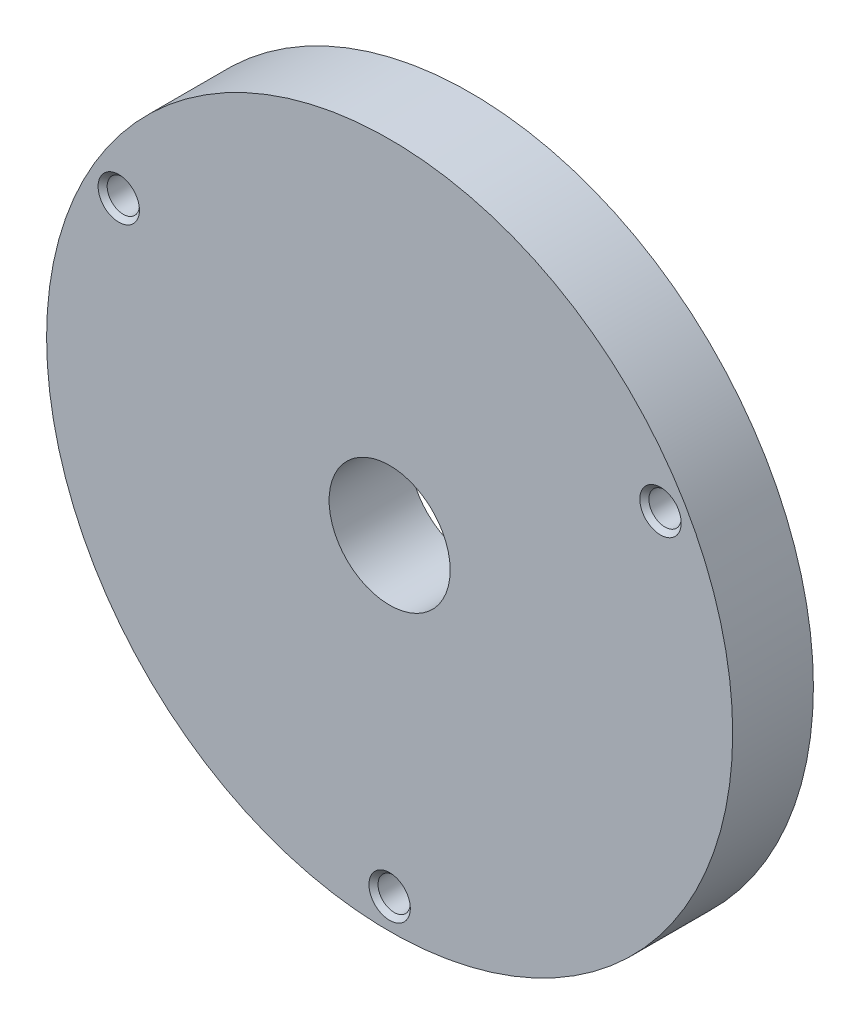
ISO-10303-21;
HEADER;
FILE_DESCRIPTION(('STEP AP214'),'2;1');
FILE_NAME('part.step','',(''),(''),'','','');
FILE_SCHEMA(('AUTOMOTIVE_DESIGN { 1 0 10303 214 1 1 1 1 }'));
ENDSEC;
DATA;
#1=APPLICATION_CONTEXT('core data for automotive mechanical design processes');
#2=APPLICATION_PROTOCOL_DEFINITION('international standard','automotive_design',2000,#1);
#3=PRODUCT_CONTEXT('',#1,'mechanical');
#4=PRODUCT('Part','Part','',(#3));
#5=PRODUCT_RELATED_PRODUCT_CATEGORY('part','',(#4));
#6=PRODUCT_DEFINITION_FORMATION('','',#4);
#7=PRODUCT_DEFINITION_CONTEXT('part definition',#1,'design');
#8=PRODUCT_DEFINITION('design','',#6,#7);
#9=PRODUCT_DEFINITION_SHAPE('','',#8);
#10=(LENGTH_UNIT() NAMED_UNIT(*) SI_UNIT(.MILLI.,.METRE.));
#11=(NAMED_UNIT(*) PLANE_ANGLE_UNIT() SI_UNIT($,.RADIAN.));
#12=(NAMED_UNIT(*) SI_UNIT($,.STERADIAN.) SOLID_ANGLE_UNIT());
#13=UNCERTAINTY_MEASURE_WITH_UNIT(LENGTH_MEASURE(1.E-05),#10,'distance_accuracy_value','');
#14=(GEOMETRIC_REPRESENTATION_CONTEXT(3) GLOBAL_UNCERTAINTY_ASSIGNED_CONTEXT((#13)) GLOBAL_UNIT_ASSIGNED_CONTEXT((#10,
#11,#12)) REPRESENTATION_CONTEXT('',''));
#15=CARTESIAN_POINT('',(0.,0.,0.));
#16=DIRECTION('',(0.,0.,1.));
#17=DIRECTION('',(1.,0.,0.));
#18=AXIS2_PLACEMENT_3D('',#15,#16,#17);
#19=CARTESIAN_POINT('',(0.,0.,-4.));
#20=DIRECTION('',(0.,0.,1.));
#21=DIRECTION('',(1.,0.,0.));
#22=AXIS2_PLACEMENT_3D('',#19,#20,#21);
#23=CYLINDRICAL_SURFACE('',#22,17.);
#24=CARTESIAN_POINT('',(0.,0.,-4.));
#25=DIRECTION('',(0.,0.,1.));
#26=DIRECTION('',(1.,0.,0.));
#27=AXIS2_PLACEMENT_3D('',#24,#25,#26);
#28=CIRCLE('',#27,17.);
#29=CARTESIAN_POINT('',(17.,0.,-4.));
#30=VERTEX_POINT('',#29);
#31=EDGE_CURVE('E10',#30,#30,#28,.T.);
#32=ORIENTED_EDGE('',*,*,#31,.T.);
#33=EDGE_LOOP('',(#32));
#34=FACE_BOUND('',#33,.T.);
#35=CARTESIAN_POINT('',(0.,0.,0.));
#36=DIRECTION('',(0.,0.,1.));
#37=DIRECTION('',(1.,0.,0.));
#38=AXIS2_PLACEMENT_3D('',#35,#36,#37);
#39=CIRCLE('',#38,17.);
#40=CARTESIAN_POINT('',(17.,0.,0.));
#41=VERTEX_POINT('',#40);
#42=EDGE_CURVE('E36',#41,#41,#39,.T.);
#43=ORIENTED_EDGE('',*,*,#42,.F.);
#44=EDGE_LOOP('',(#43));
#45=FACE_BOUND('',#44,.T.);
#46=ADVANCED_FACE('F33',(#34,#45),#23,.T.);
#47=CARTESIAN_POINT('',(0.,0.,-4.));
#48=DIRECTION('',(0.,0.,1.));
#49=DIRECTION('',(1.,0.,0.));
#50=AXIS2_PLACEMENT_3D('',#47,#48,#49);
#51=PLANE('',#50);
#52=CARTESIAN_POINT('',(0.,0.,-4.));
#53=DIRECTION('',(0.,0.,1.));
#54=DIRECTION('',(1.,0.,0.));
#55=AXIS2_PLACEMENT_3D('',#52,#53,#54);
#56=CIRCLE('',#55,3.);
#57=CARTESIAN_POINT('',(3.,0.,-4.));
#58=VERTEX_POINT('',#57);
#59=EDGE_CURVE('E71',#58,#58,#56,.T.);
#60=ORIENTED_EDGE('',*,*,#59,.T.);
#61=EDGE_LOOP('',(#60));
#62=FACE_BOUND('',#61,.T.);
#63=CARTESIAN_POINT('',(-13.4233937586589,7.74999999999987,-4.));
#64=DIRECTION('',(0.,0.,1.));
#65=DIRECTION('',(1.,0.,0.));
#66=AXIS2_PLACEMENT_3D('',#63,#64,#65);
#67=CIRCLE('',#66,0.799999999999986);
#68=CARTESIAN_POINT('',(-12.6233937586589,7.74999999999987,-4.));
#69=VERTEX_POINT('',#68);
#70=EDGE_CURVE('E62',#69,#69,#67,.T.);
#71=ORIENTED_EDGE('',*,*,#70,.T.);
#72=EDGE_LOOP('',(#71));
#73=FACE_BOUND('',#72,.T.);
#74=CARTESIAN_POINT('',(13.4233937586588,7.75000000000006,-4.));
#75=DIRECTION('',(0.,0.,1.));
#76=DIRECTION('',(1.,0.,0.));
#77=AXIS2_PLACEMENT_3D('',#74,#75,#76);
#78=CIRCLE('',#77,0.799999999999986);
#79=CARTESIAN_POINT('',(14.2233937586587,7.75000000000006,-4.));
#80=VERTEX_POINT('',#79);
#81=EDGE_CURVE('E53',#80,#80,#78,.T.);
#82=ORIENTED_EDGE('',*,*,#81,.T.);
#83=EDGE_LOOP('',(#82));
#84=FACE_BOUND('',#83,.T.);
#85=CARTESIAN_POINT('',(0.,-15.5,-4.));
#86=DIRECTION('',(0.,0.,1.));
#87=DIRECTION('',(1.,0.,0.));
#88=AXIS2_PLACEMENT_3D('',#85,#86,#87);
#89=CIRCLE('',#88,0.799999999999987);
#90=CARTESIAN_POINT('',(0.799999999999989,-15.5,-4.));
#91=VERTEX_POINT('',#90);
#92=EDGE_CURVE('E43',#91,#91,#89,.T.);
#93=ORIENTED_EDGE('',*,*,#92,.T.);
#94=EDGE_LOOP('',(#93));
#95=FACE_BOUND('',#94,.T.);
#96=ORIENTED_EDGE('',*,*,#31,.F.);
#97=EDGE_LOOP('',(#96));
#98=FACE_BOUND('',#97,.T.);
#99=ADVANCED_FACE('F78',(#62,#73,#84,#95,#98),#51,.F.);
#100=CARTESIAN_POINT('',(0.,0.,0.));
#101=DIRECTION('',(0.,0.,1.));
#102=DIRECTION('',(1.,0.,0.));
#103=AXIS2_PLACEMENT_3D('',#100,#101,#102);
#104=PLANE('',#103);
#105=CARTESIAN_POINT('',(0.,0.,0.));
#106=DIRECTION('',(0.,0.,1.));
#107=DIRECTION('',(1.,0.,0.));
#108=AXIS2_PLACEMENT_3D('',#105,#106,#107);
#109=CIRCLE('',#108,3.);
#110=CARTESIAN_POINT('',(3.,0.,0.));
#111=VERTEX_POINT('',#110);
#112=EDGE_CURVE('E72',#111,#111,#109,.T.);
#113=ORIENTED_EDGE('',*,*,#112,.F.);
#114=EDGE_LOOP('',(#113));
#115=FACE_BOUND('',#114,.T.);
#116=CARTESIAN_POINT('',(-13.4233937586589,7.74999999999987,0.));
#117=DIRECTION('',(0.,0.,1.));
#118=DIRECTION('',(1.,0.,0.));
#119=AXIS2_PLACEMENT_3D('',#116,#117,#118);
#120=CIRCLE('',#119,1.025);
#121=CARTESIAN_POINT('',(-12.3983937586589,7.74999999999987,0.));
#122=VERTEX_POINT('',#121);
#123=EDGE_CURVE('E68',#122,#122,#120,.T.);
#124=ORIENTED_EDGE('',*,*,#123,.F.);
#125=EDGE_LOOP('',(#124));
#126=FACE_BOUND('',#125,.T.);
#127=CARTESIAN_POINT('',(13.4233937586588,7.75000000000006,0.));
#128=DIRECTION('',(0.,0.,1.));
#129=DIRECTION('',(1.,0.,0.));
#130=AXIS2_PLACEMENT_3D('',#127,#128,#129);
#131=CIRCLE('',#130,1.025);
#132=CARTESIAN_POINT('',(14.4483937586588,7.75000000000006,0.));
#133=VERTEX_POINT('',#132);
#134=EDGE_CURVE('E59',#133,#133,#131,.T.);
#135=ORIENTED_EDGE('',*,*,#134,.F.);
#136=EDGE_LOOP('',(#135));
#137=FACE_BOUND('',#136,.T.);
#138=CARTESIAN_POINT('',(0.,-15.5,0.));
#139=DIRECTION('',(0.,0.,1.));
#140=DIRECTION('',(1.,0.,0.));
#141=AXIS2_PLACEMENT_3D('',#138,#139,#140);
#142=CIRCLE('',#141,1.025);
#143=CARTESIAN_POINT('',(1.025,-15.5,0.));
#144=VERTEX_POINT('',#143);
#145=EDGE_CURVE('E50',#144,#144,#142,.T.);
#146=ORIENTED_EDGE('',*,*,#145,.F.);
#147=EDGE_LOOP('',(#146));
#148=FACE_BOUND('',#147,.T.);
#149=ORIENTED_EDGE('',*,*,#42,.T.);
#150=EDGE_LOOP('',(#149));
#151=FACE_BOUND('',#150,.T.);
#152=ADVANCED_FACE('F88',(#115,#126,#137,#148,#151),#104,.T.);
#153=CARTESIAN_POINT('',(0.,-15.5,0.));
#154=DIRECTION('',(0.,0.,1.));
#155=DIRECTION('',(1.,0.,0.));
#156=AXIS2_PLACEMENT_3D('',#153,#154,#155);
#157=CYLINDRICAL_SURFACE('',#156,0.799999999999993);
#158=ORIENTED_EDGE('',*,*,#92,.F.);
#159=EDGE_LOOP('',(#158));
#160=FACE_BOUND('',#159,.T.);
#161=CARTESIAN_POINT('',(0.,-15.5,-0.225));
#162=DIRECTION('',(0.,0.,1.));
#163=DIRECTION('',(1.,0.,0.));
#164=AXIS2_PLACEMENT_3D('',#161,#162,#163);
#165=CIRCLE('',#164,0.799999999999999);
#166=CARTESIAN_POINT('',(0.800000000000001,-15.5,-0.225));
#167=VERTEX_POINT('',#166);
#168=EDGE_CURVE('E47',#167,#167,#165,.T.);
#169=ORIENTED_EDGE('',*,*,#168,.T.);
#170=EDGE_LOOP('',(#169));
#171=FACE_BOUND('',#170,.T.);
#172=ADVANCED_FACE('F91',(#160,#171),#157,.F.);
#173=CARTESIAN_POINT('',(0.,-15.5,0.));
#174=DIRECTION('',(0.,0.,1.));
#175=DIRECTION('',(1.,0.,0.));
#176=AXIS2_PLACEMENT_3D('',#173,#174,#175);
#177=CONICAL_SURFACE('',#176,1.025,0.785398163397445);
#178=ORIENTED_EDGE('',*,*,#168,.F.);
#179=EDGE_LOOP('',(#178));
#180=FACE_BOUND('',#179,.T.);
#181=ORIENTED_EDGE('',*,*,#145,.T.);
#182=EDGE_LOOP('',(#181));
#183=FACE_BOUND('',#182,.T.);
#184=ADVANCED_FACE('F110',(#180,#183),#177,.F.);
#185=CARTESIAN_POINT('',(13.4233937586588,7.75000000000006,0.));
#186=DIRECTION('',(0.,0.,1.));
#187=DIRECTION('',(1.,0.,0.));
#188=AXIS2_PLACEMENT_3D('',#185,#186,#187);
#189=CYLINDRICAL_SURFACE('',#188,0.799999999999993);
#190=ORIENTED_EDGE('',*,*,#81,.F.);
#191=EDGE_LOOP('',(#190));
#192=FACE_BOUND('',#191,.T.);
#193=CARTESIAN_POINT('',(13.4233937586588,7.75000000000006,-0.225));
#194=DIRECTION('',(0.,0.,1.));
#195=DIRECTION('',(1.,0.,0.));
#196=AXIS2_PLACEMENT_3D('',#193,#194,#195);
#197=CIRCLE('',#196,0.799999999999999);
#198=CARTESIAN_POINT('',(14.2233937586588,7.75000000000006,-0.225));
#199=VERTEX_POINT('',#198);
#200=EDGE_CURVE('E56',#199,#199,#197,.T.);
#201=ORIENTED_EDGE('',*,*,#200,.T.);
#202=EDGE_LOOP('',(#201));
#203=FACE_BOUND('',#202,.T.);
#204=ADVANCED_FACE('F114',(#192,#203),#189,.F.);
#205=CARTESIAN_POINT('',(13.4233937586588,7.75000000000006,0.));
#206=DIRECTION('',(0.,0.,1.));
#207=DIRECTION('',(1.,0.,0.));
#208=AXIS2_PLACEMENT_3D('',#205,#206,#207);
#209=CONICAL_SURFACE('',#208,1.025,0.785398163397446);
#210=ORIENTED_EDGE('',*,*,#200,.F.);
#211=EDGE_LOOP('',(#210));
#212=FACE_BOUND('',#211,.T.);
#213=ORIENTED_EDGE('',*,*,#134,.T.);
#214=EDGE_LOOP('',(#213));
#215=FACE_BOUND('',#214,.T.);
#216=ADVANCED_FACE('F118',(#212,#215),#209,.F.);
#217=CARTESIAN_POINT('',(-13.4233937586589,7.74999999999987,0.));
#218=DIRECTION('',(0.,0.,1.));
#219=DIRECTION('',(1.,0.,0.));
#220=AXIS2_PLACEMENT_3D('',#217,#218,#219);
#221=CYLINDRICAL_SURFACE('',#220,0.799999999999993);
#222=ORIENTED_EDGE('',*,*,#70,.F.);
#223=EDGE_LOOP('',(#222));
#224=FACE_BOUND('',#223,.T.);
#225=CARTESIAN_POINT('',(-13.4233937586589,7.74999999999987,-0.225));
#226=DIRECTION('',(0.,0.,1.));
#227=DIRECTION('',(1.,0.,0.));
#228=AXIS2_PLACEMENT_3D('',#225,#226,#227);
#229=CIRCLE('',#228,0.799999999999999);
#230=CARTESIAN_POINT('',(-12.6233937586589,7.74999999999987,-0.225));
#231=VERTEX_POINT('',#230);
#232=EDGE_CURVE('E65',#231,#231,#229,.T.);
#233=ORIENTED_EDGE('',*,*,#232,.T.);
#234=EDGE_LOOP('',(#233));
#235=FACE_BOUND('',#234,.T.);
#236=ADVANCED_FACE('F122',(#224,#235),#221,.F.);
#237=CARTESIAN_POINT('',(-13.4233937586589,7.74999999999987,0.));
#238=DIRECTION('',(0.,0.,1.));
#239=DIRECTION('',(1.,0.,0.));
#240=AXIS2_PLACEMENT_3D('',#237,#238,#239);
#241=CONICAL_SURFACE('',#240,1.025,0.785398163397446);
#242=ORIENTED_EDGE('',*,*,#232,.F.);
#243=EDGE_LOOP('',(#242));
#244=FACE_BOUND('',#243,.T.);
#245=ORIENTED_EDGE('',*,*,#123,.T.);
#246=EDGE_LOOP('',(#245));
#247=FACE_BOUND('',#246,.T.);
#248=ADVANCED_FACE('F84',(#244,#247),#241,.F.);
#249=CARTESIAN_POINT('',(0.,0.,-4.));
#250=DIRECTION('',(0.,0.,1.));
#251=DIRECTION('',(1.,0.,0.));
#252=AXIS2_PLACEMENT_3D('',#249,#250,#251);
#253=CYLINDRICAL_SURFACE('',#252,3.);
#254=ORIENTED_EDGE('',*,*,#59,.F.);
#255=EDGE_LOOP('',(#254));
#256=FACE_BOUND('',#255,.T.);
#257=ORIENTED_EDGE('',*,*,#112,.T.);
#258=EDGE_LOOP('',(#257));
#259=FACE_BOUND('',#258,.T.);
#260=ADVANCED_FACE('F81',(#256,#259),#253,.F.);
#261=CLOSED_SHELL('',(#46,#99,#152,#172,#184,#204,#216,#236,#248,#260));
#262=MANIFOLD_SOLID_BREP('B2',#261);
#263=ADVANCED_BREP_SHAPE_REPRESENTATION('',(#18,#262),#14);
#264=SHAPE_DEFINITION_REPRESENTATION(#9,#263);
ENDSEC;
END-ISO-10303-21;
